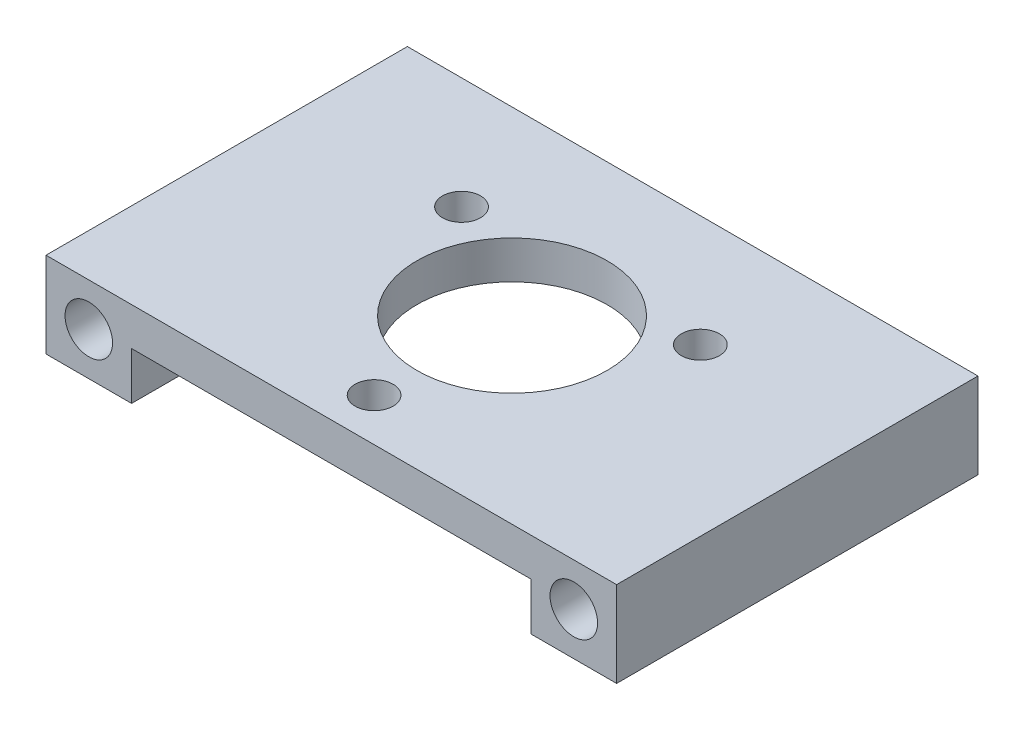
ISO-10303-21;
HEADER;
FILE_DESCRIPTION(('STEP AP214'),'2;1');
FILE_NAME('part.step','',(''),(''),'','','');
FILE_SCHEMA(('AUTOMOTIVE_DESIGN { 1 0 10303 214 1 1 1 1 }'));
ENDSEC;
DATA;
#1=APPLICATION_CONTEXT('core data for automotive mechanical design processes');
#2=APPLICATION_PROTOCOL_DEFINITION('international standard','automotive_design',2000,#1);
#3=PRODUCT_CONTEXT('',#1,'mechanical');
#4=PRODUCT('Part','Part','',(#3));
#5=PRODUCT_RELATED_PRODUCT_CATEGORY('part','',(#4));
#6=PRODUCT_DEFINITION_FORMATION('','',#4);
#7=PRODUCT_DEFINITION_CONTEXT('part definition',#1,'design');
#8=PRODUCT_DEFINITION('design','',#6,#7);
#9=PRODUCT_DEFINITION_SHAPE('','',#8);
#10=(LENGTH_UNIT() NAMED_UNIT(*) SI_UNIT(.MILLI.,.METRE.));
#11=(NAMED_UNIT(*) PLANE_ANGLE_UNIT() SI_UNIT($,.RADIAN.));
#12=(NAMED_UNIT(*) SI_UNIT($,.STERADIAN.) SOLID_ANGLE_UNIT());
#13=UNCERTAINTY_MEASURE_WITH_UNIT(LENGTH_MEASURE(1.E-05),#10,'distance_accuracy_value','');
#14=(GEOMETRIC_REPRESENTATION_CONTEXT(3) GLOBAL_UNCERTAINTY_ASSIGNED_CONTEXT((#13)) GLOBAL_UNIT_ASSIGNED_CONTEXT((#10,
#11,#12)) REPRESENTATION_CONTEXT('',''));
#15=CARTESIAN_POINT('',(0.,0.,0.));
#16=DIRECTION('',(0.,0.,1.));
#17=DIRECTION('',(1.,0.,0.));
#18=AXIS2_PLACEMENT_3D('',#15,#16,#17);
#19=CARTESIAN_POINT('',(32.5614985856646,-4.80041123780256,8.13630311528777));
#20=DIRECTION('',(0.,0.,-1.));
#21=DIRECTION('',(-1.,0.,0.));
#22=AXIS2_PLACEMENT_3D('',#19,#20,#21);
#23=PLANE('',#22);
#24=DIRECTION('',(-1.,0.,0.));
#25=VECTOR('',#24,1.);
#26=CARTESIAN_POINT('',(2.5614985856646,-4.80041123780256,8.13630311528777));
#27=LINE('',#26,#25);
#28=CARTESIAN_POINT('',(62.5614985856646,-4.80041123780256,8.13630311528777));
#29=VERTEX_POINT('',#28);
#30=CARTESIAN_POINT('',(2.5614985856646,-4.80041123780256,8.13630311528777));
#31=VERTEX_POINT('',#30);
#32=EDGE_CURVE('E130',#29,#31,#27,.T.);
#33=ORIENTED_EDGE('',*,*,#32,.T.);
#34=DIRECTION('',(0.,-1.,0.));
#35=VECTOR('',#34,1.);
#36=CARTESIAN_POINT('',(2.5614985856646,-4.80041123780256,8.13630311528777));
#37=LINE('',#36,#35);
#38=CARTESIAN_POINT('',(2.5614985856646,-13.8004112378026,8.13630311528777));
#39=VERTEX_POINT('',#38);
#40=EDGE_CURVE('E78',#31,#39,#37,.T.);
#41=ORIENTED_EDGE('',*,*,#40,.T.);
#42=DIRECTION('',(1.,0.,0.));
#43=VECTOR('',#42,1.);
#44=CARTESIAN_POINT('',(2.5614985856646,-13.8004112378026,8.13630311528777));
#45=LINE('',#44,#43);
#46=CARTESIAN_POINT('',(11.5614985856646,-13.8004112378026,8.13630311528777));
#47=VERTEX_POINT('',#46);
#48=EDGE_CURVE('E145',#39,#47,#45,.T.);
#49=ORIENTED_EDGE('',*,*,#48,.T.);
#50=DIRECTION('',(0.,1.,0.));
#51=VECTOR('',#50,1.);
#52=CARTESIAN_POINT('',(11.5614985856646,-13.8004112378026,8.13630311528777));
#53=LINE('',#52,#51);
#54=CARTESIAN_POINT('',(11.5614985856646,-8.80041123780256,8.13630311528777));
#55=VERTEX_POINT('',#54);
#56=EDGE_CURVE('E158',#47,#55,#53,.T.);
#57=ORIENTED_EDGE('',*,*,#56,.T.);
#58=DIRECTION('',(1.,0.,0.));
#59=VECTOR('',#58,1.);
#60=CARTESIAN_POINT('',(11.5614985856646,-8.80041123780256,8.13630311528777));
#61=LINE('',#60,#59);
#62=CARTESIAN_POINT('',(53.5614985856646,-8.80041123780256,8.13630311528777));
#63=VERTEX_POINT('',#62);
#64=EDGE_CURVE('E97',#55,#63,#61,.T.);
#65=ORIENTED_EDGE('',*,*,#64,.T.);
#66=DIRECTION('',(0.,-1.,0.));
#67=VECTOR('',#66,1.);
#68=CARTESIAN_POINT('',(53.5614985856646,-13.8004112378026,8.13630311528777));
#69=LINE('',#68,#67);
#70=CARTESIAN_POINT('',(53.5614985856646,-13.8004112378026,8.13630311528777));
#71=VERTEX_POINT('',#70);
#72=EDGE_CURVE('E91',#63,#71,#69,.T.);
#73=ORIENTED_EDGE('',*,*,#72,.T.);
#74=DIRECTION('',(1.,0.,0.));
#75=VECTOR('',#74,1.);
#76=CARTESIAN_POINT('',(62.5614985856646,-13.8004112378026,8.13630311528777));
#77=LINE('',#76,#75);
#78=CARTESIAN_POINT('',(62.5614985856646,-13.8004112378026,8.13630311528777));
#79=VERTEX_POINT('',#78);
#80=EDGE_CURVE('E95',#71,#79,#77,.T.);
#81=ORIENTED_EDGE('',*,*,#80,.T.);
#82=DIRECTION('',(0.,1.,0.));
#83=VECTOR('',#82,1.);
#84=CARTESIAN_POINT('',(62.5614985856646,-4.80041123780256,8.13630311528777));
#85=LINE('',#84,#83);
#86=EDGE_CURVE('E35',#79,#29,#85,.T.);
#87=ORIENTED_EDGE('',*,*,#86,.T.);
#88=EDGE_LOOP('',(#33,#41,#49,#57,#65,#73,#81,#87));
#89=FACE_BOUND('',#88,.T.);
#90=CARTESIAN_POINT('',(58.0614985856646,-9.30041123780256,8.13630311528777));
#91=DIRECTION('',(0.,0.,1.));
#92=DIRECTION('',(-1.,0.,0.));
#93=AXIS2_PLACEMENT_3D('',#90,#91,#92);
#94=CIRCLE('',#93,2.5);
#95=CARTESIAN_POINT('',(55.5614985856646,-9.30041123780256,8.13630311528777));
#96=VERTEX_POINT('',#95);
#97=EDGE_CURVE('E119',#96,#96,#94,.T.);
#98=ORIENTED_EDGE('',*,*,#97,.F.);
#99=EDGE_LOOP('',(#98));
#100=FACE_BOUND('',#99,.T.);
#101=CARTESIAN_POINT('',(7.0614985856646,-9.30041123780256,8.13630311528777));
#102=DIRECTION('',(0.,0.,1.));
#103=DIRECTION('',(1.,0.,0.));
#104=AXIS2_PLACEMENT_3D('',#101,#102,#103);
#105=CIRCLE('',#104,2.5);
#106=CARTESIAN_POINT('',(9.56149858566459,-9.30041123780256,8.13630311528777));
#107=VERTEX_POINT('',#106);
#108=EDGE_CURVE('E167',#107,#107,#105,.T.);
#109=ORIENTED_EDGE('',*,*,#108,.F.);
#110=EDGE_LOOP('',(#109));
#111=FACE_BOUND('',#110,.T.);
#112=ADVANCED_FACE('F18',(#89,#100,#111),#23,.F.);
#113=CARTESIAN_POINT('',(32.5614985856646,-4.80041123780256,-29.8636968847122));
#114=DIRECTION('',(0.,0.,-1.));
#115=DIRECTION('',(-1.,0.,0.));
#116=AXIS2_PLACEMENT_3D('',#113,#114,#115);
#117=PLANE('',#116);
#118=CARTESIAN_POINT('',(58.0614985856646,-9.30041123780256,-29.8636968847122));
#119=DIRECTION('',(0.,0.,1.));
#120=DIRECTION('',(-1.,0.,0.));
#121=AXIS2_PLACEMENT_3D('',#118,#119,#120);
#122=CIRCLE('',#121,2.5);
#123=CARTESIAN_POINT('',(55.5614985856646,-9.30041123780256,-29.8636968847122));
#124=VERTEX_POINT('',#123);
#125=EDGE_CURVE('E164',#124,#124,#122,.T.);
#126=ORIENTED_EDGE('',*,*,#125,.T.);
#127=EDGE_LOOP('',(#126));
#128=FACE_BOUND('',#127,.T.);
#129=DIRECTION('',(-1.,0.,0.));
#130=VECTOR('',#129,1.);
#131=CARTESIAN_POINT('',(2.5614985856646,-4.80041123780256,-29.8636968847122));
#132=LINE('',#131,#130);
#133=CARTESIAN_POINT('',(62.5614985856646,-4.80041123780256,-29.8636968847122));
#134=VERTEX_POINT('',#133);
#135=CARTESIAN_POINT('',(2.5614985856646,-4.80041123780256,-29.8636968847122));
#136=VERTEX_POINT('',#135);
#137=EDGE_CURVE('E115',#134,#136,#132,.T.);
#138=ORIENTED_EDGE('',*,*,#137,.F.);
#139=DIRECTION('',(0.,1.,0.));
#140=VECTOR('',#139,1.);
#141=CARTESIAN_POINT('',(62.5614985856646,-4.80041123780256,-29.8636968847122));
#142=LINE('',#141,#140);
#143=CARTESIAN_POINT('',(62.5614985856646,-13.8004112378026,-29.8636968847122));
#144=VERTEX_POINT('',#143);
#145=EDGE_CURVE('E70',#144,#134,#142,.T.);
#146=ORIENTED_EDGE('',*,*,#145,.F.);
#147=DIRECTION('',(1.,0.,0.));
#148=VECTOR('',#147,1.);
#149=CARTESIAN_POINT('',(62.5614985856646,-13.8004112378026,-29.8636968847122));
#150=LINE('',#149,#148);
#151=CARTESIAN_POINT('',(53.5614985856646,-13.8004112378026,-29.8636968847122));
#152=VERTEX_POINT('',#151);
#153=EDGE_CURVE('E64',#152,#144,#150,.T.);
#154=ORIENTED_EDGE('',*,*,#153,.F.);
#155=DIRECTION('',(0.,-1.,0.));
#156=VECTOR('',#155,1.);
#157=CARTESIAN_POINT('',(53.5614985856646,-13.8004112378026,-29.8636968847122));
#158=LINE('',#157,#156);
#159=CARTESIAN_POINT('',(53.5614985856646,-8.80041123780256,-29.8636968847122));
#160=VERTEX_POINT('',#159);
#161=EDGE_CURVE('E105',#160,#152,#158,.T.);
#162=ORIENTED_EDGE('',*,*,#161,.F.);
#163=DIRECTION('',(1.,0.,0.));
#164=VECTOR('',#163,1.);
#165=CARTESIAN_POINT('',(11.5614985856646,-8.80041123780256,-29.8636968847122));
#166=LINE('',#165,#164);
#167=CARTESIAN_POINT('',(11.5614985856646,-8.80041123780256,-29.8636968847122));
#168=VERTEX_POINT('',#167);
#169=EDGE_CURVE('E125',#168,#160,#166,.T.);
#170=ORIENTED_EDGE('',*,*,#169,.F.);
#171=DIRECTION('',(0.,1.,0.));
#172=VECTOR('',#171,1.);
#173=CARTESIAN_POINT('',(11.5614985856646,-13.8004112378026,-29.8636968847122));
#174=LINE('',#173,#172);
#175=CARTESIAN_POINT('',(11.5614985856646,-13.8004112378026,-29.8636968847122));
#176=VERTEX_POINT('',#175);
#177=EDGE_CURVE('E123',#176,#168,#174,.T.);
#178=ORIENTED_EDGE('',*,*,#177,.F.);
#179=DIRECTION('',(1.,0.,0.));
#180=VECTOR('',#179,1.);
#181=CARTESIAN_POINT('',(2.5614985856646,-13.8004112378026,-29.8636968847122));
#182=LINE('',#181,#180);
#183=CARTESIAN_POINT('',(2.5614985856646,-13.8004112378026,-29.8636968847122));
#184=VERTEX_POINT('',#183);
#185=EDGE_CURVE('E121',#184,#176,#182,.T.);
#186=ORIENTED_EDGE('',*,*,#185,.F.);
#187=DIRECTION('',(0.,-1.,0.));
#188=VECTOR('',#187,1.);
#189=CARTESIAN_POINT('',(2.5614985856646,-4.80041123780256,-29.8636968847122));
#190=LINE('',#189,#188);
#191=EDGE_CURVE('E118',#136,#184,#190,.T.);
#192=ORIENTED_EDGE('',*,*,#191,.F.);
#193=EDGE_LOOP('',(#138,#146,#154,#162,#170,#178,#186,#192));
#194=FACE_BOUND('',#193,.T.);
#195=CARTESIAN_POINT('',(7.0614985856646,-9.30041123780256,-29.8636968847122));
#196=DIRECTION('',(0.,0.,1.));
#197=DIRECTION('',(1.,0.,0.));
#198=AXIS2_PLACEMENT_3D('',#195,#196,#197);
#199=CIRCLE('',#198,2.5);
#200=CARTESIAN_POINT('',(9.56149858566459,-9.30041123780256,-29.8636968847122));
#201=VERTEX_POINT('',#200);
#202=EDGE_CURVE('E170',#201,#201,#199,.T.);
#203=ORIENTED_EDGE('',*,*,#202,.T.);
#204=EDGE_LOOP('',(#203));
#205=FACE_BOUND('',#204,.T.);
#206=ADVANCED_FACE('F149',(#128,#194,#205),#117,.T.);
#207=CARTESIAN_POINT('',(2.5614985856646,-4.80041123780256,8.13630311528777));
#208=DIRECTION('',(0.,-1.,0.));
#209=DIRECTION('',(1.,0.,0.));
#210=AXIS2_PLACEMENT_3D('',#207,#208,#209);
#211=PLANE('',#210);
#212=CARTESIAN_POINT('',(20.0041302307911,-4.80041123780256,-18.1136968847126));
#213=DIRECTION('',(0.,-1.,0.));
#214=DIRECTION('',(1.,0.,0.));
#215=AXIS2_PLACEMENT_3D('',#212,#213,#214);
#216=CIRCLE('',#215,2.);
#217=CARTESIAN_POINT('',(22.0041302307911,-4.80041123780256,-18.1136968847126));
#218=VERTEX_POINT('',#217);
#219=EDGE_CURVE('E173',#218,#218,#216,.T.);
#220=ORIENTED_EDGE('',*,*,#219,.T.);
#221=EDGE_LOOP('',(#220));
#222=FACE_BOUND('',#221,.T.);
#223=CARTESIAN_POINT('',(45.1188669405398,-4.80041123780256,-18.1136968847118));
#224=DIRECTION('',(0.,-1.,0.));
#225=DIRECTION('',(1.,0.,0.));
#226=AXIS2_PLACEMENT_3D('',#223,#224,#225);
#227=CIRCLE('',#226,2.);
#228=CARTESIAN_POINT('',(47.1188669405399,-4.80041123780256,-18.1136968847118));
#229=VERTEX_POINT('',#228);
#230=EDGE_CURVE('E178',#229,#229,#227,.T.);
#231=ORIENTED_EDGE('',*,*,#230,.T.);
#232=EDGE_LOOP('',(#231));
#233=FACE_BOUND('',#232,.T.);
#234=CARTESIAN_POINT('',(32.5614985856646,-4.80041123780256,3.63630311528778));
#235=DIRECTION('',(0.,-1.,0.));
#236=DIRECTION('',(1.,0.,0.));
#237=AXIS2_PLACEMENT_3D('',#234,#235,#236);
#238=CIRCLE('',#237,2.);
#239=CARTESIAN_POINT('',(34.5614985856646,-4.80041123780256,3.63630311528778));
#240=VERTEX_POINT('',#239);
#241=EDGE_CURVE('E181',#240,#240,#238,.T.);
#242=ORIENTED_EDGE('',*,*,#241,.T.);
#243=EDGE_LOOP('',(#242));
#244=FACE_BOUND('',#243,.T.);
#245=CARTESIAN_POINT('',(32.5614985856646,-4.80041123780256,-10.8636968847122));
#246=DIRECTION('',(0.,-1.,0.));
#247=DIRECTION('',(1.,0.,0.));
#248=AXIS2_PLACEMENT_3D('',#245,#246,#247);
#249=CIRCLE('',#248,10.);
#250=CARTESIAN_POINT('',(42.5614985856646,-4.80041123780256,-10.8636968847122));
#251=VERTEX_POINT('',#250);
#252=EDGE_CURVE('E184',#251,#251,#249,.T.);
#253=ORIENTED_EDGE('',*,*,#252,.T.);
#254=EDGE_LOOP('',(#253));
#255=FACE_BOUND('',#254,.T.);
#256=ORIENTED_EDGE('',*,*,#137,.T.);
#257=DIRECTION('',(0.,0.,-1.));
#258=VECTOR('',#257,1.);
#259=CARTESIAN_POINT('',(2.5614985856646,-4.80041123780256,8.13630311528777));
#260=LINE('',#259,#258);
#261=EDGE_CURVE('E10',#31,#136,#260,.T.);
#262=ORIENTED_EDGE('',*,*,#261,.F.);
#263=ORIENTED_EDGE('',*,*,#32,.F.);
#264=DIRECTION('',(0.,0.,-1.));
#265=VECTOR('',#264,1.);
#266=CARTESIAN_POINT('',(62.5614985856646,-4.80041123780256,8.13630311528777));
#267=LINE('',#266,#265);
#268=EDGE_CURVE('E111',#29,#134,#267,.T.);
#269=ORIENTED_EDGE('',*,*,#268,.T.);
#270=EDGE_LOOP('',(#256,#262,#263,#269));
#271=FACE_BOUND('',#270,.T.);
#272=ADVANCED_FACE('F20',(#222,#233,#244,#255,#271),#211,.F.);
#273=CARTESIAN_POINT('',(2.5614985856646,-4.80041123780256,8.13630311528777));
#274=DIRECTION('',(1.,0.,0.));
#275=DIRECTION('',(0.,0.,-1.));
#276=AXIS2_PLACEMENT_3D('',#273,#274,#275);
#277=PLANE('',#276);
#278=ORIENTED_EDGE('',*,*,#191,.T.);
#279=DIRECTION('',(0.,0.,-1.));
#280=VECTOR('',#279,1.);
#281=CARTESIAN_POINT('',(2.5614985856646,-13.8004112378026,8.13630311528777));
#282=LINE('',#281,#280);
#283=EDGE_CURVE('E27',#39,#184,#282,.T.);
#284=ORIENTED_EDGE('',*,*,#283,.F.);
#285=ORIENTED_EDGE('',*,*,#40,.F.);
#286=ORIENTED_EDGE('',*,*,#261,.T.);
#287=EDGE_LOOP('',(#278,#284,#285,#286));
#288=FACE_BOUND('',#287,.T.);
#289=ADVANCED_FACE('F218',(#288),#277,.F.);
#290=CARTESIAN_POINT('',(2.5614985856646,-13.8004112378026,8.13630311528777));
#291=DIRECTION('',(0.,1.,0.));
#292=DIRECTION('',(0.,0.,1.));
#293=AXIS2_PLACEMENT_3D('',#290,#291,#292);
#294=PLANE('',#293);
#295=ORIENTED_EDGE('',*,*,#185,.T.);
#296=DIRECTION('',(0.,0.,-1.));
#297=VECTOR('',#296,1.);
#298=CARTESIAN_POINT('',(11.5614985856646,-13.8004112378026,8.13630311528777));
#299=LINE('',#298,#297);
#300=EDGE_CURVE('E137',#47,#176,#299,.T.);
#301=ORIENTED_EDGE('',*,*,#300,.F.);
#302=ORIENTED_EDGE('',*,*,#48,.F.);
#303=ORIENTED_EDGE('',*,*,#283,.T.);
#304=EDGE_LOOP('',(#295,#301,#302,#303));
#305=FACE_BOUND('',#304,.T.);
#306=ADVANCED_FACE('F143',(#305),#294,.F.);
#307=CARTESIAN_POINT('',(11.5614985856646,-13.8004112378026,8.13630311528777));
#308=DIRECTION('',(-1.,0.,0.));
#309=DIRECTION('',(0.,0.,1.));
#310=AXIS2_PLACEMENT_3D('',#307,#308,#309);
#311=PLANE('',#310);
#312=ORIENTED_EDGE('',*,*,#177,.T.);
#313=DIRECTION('',(0.,0.,-1.));
#314=VECTOR('',#313,1.);
#315=CARTESIAN_POINT('',(11.5614985856646,-8.80041123780256,8.13630311528777));
#316=LINE('',#315,#314);
#317=EDGE_CURVE('E134',#55,#168,#316,.T.);
#318=ORIENTED_EDGE('',*,*,#317,.F.);
#319=ORIENTED_EDGE('',*,*,#56,.F.);
#320=ORIENTED_EDGE('',*,*,#300,.T.);
#321=EDGE_LOOP('',(#312,#318,#319,#320));
#322=FACE_BOUND('',#321,.T.);
#323=ADVANCED_FACE('F154',(#322),#311,.F.);
#324=CARTESIAN_POINT('',(11.5614985856646,-8.80041123780256,8.13630311528777));
#325=DIRECTION('',(0.,1.,0.));
#326=DIRECTION('',(0.,0.,1.));
#327=AXIS2_PLACEMENT_3D('',#324,#325,#326);
#328=PLANE('',#327);
#329=CARTESIAN_POINT('',(20.0041302307911,-8.80041123780256,-18.1136968847126));
#330=DIRECTION('',(0.,-1.,0.));
#331=DIRECTION('',(1.,0.,0.));
#332=AXIS2_PLACEMENT_3D('',#329,#330,#331);
#333=CIRCLE('',#332,2.);
#334=CARTESIAN_POINT('',(22.0041302307911,-8.80041123780256,-18.1136968847126));
#335=VERTEX_POINT('',#334);
#336=EDGE_CURVE('E191',#335,#335,#333,.T.);
#337=ORIENTED_EDGE('',*,*,#336,.F.);
#338=EDGE_LOOP('',(#337));
#339=FACE_BOUND('',#338,.T.);
#340=CARTESIAN_POINT('',(45.1188669405398,-8.80041123780256,-18.1136968847118));
#341=DIRECTION('',(0.,-1.,0.));
#342=DIRECTION('',(1.,0.,0.));
#343=AXIS2_PLACEMENT_3D('',#340,#341,#342);
#344=CIRCLE('',#343,2.);
#345=CARTESIAN_POINT('',(47.1188669405399,-8.80041123780256,-18.1136968847118));
#346=VERTEX_POINT('',#345);
#347=EDGE_CURVE('E194',#346,#346,#344,.T.);
#348=ORIENTED_EDGE('',*,*,#347,.F.);
#349=EDGE_LOOP('',(#348));
#350=FACE_BOUND('',#349,.T.);
#351=CARTESIAN_POINT('',(32.5614985856646,-8.80041123780256,3.63630311528778));
#352=DIRECTION('',(0.,-1.,0.));
#353=DIRECTION('',(1.,0.,0.));
#354=AXIS2_PLACEMENT_3D('',#351,#352,#353);
#355=CIRCLE('',#354,2.);
#356=CARTESIAN_POINT('',(34.5614985856646,-8.80041123780256,3.63630311528778));
#357=VERTEX_POINT('',#356);
#358=EDGE_CURVE('E190',#357,#357,#355,.T.);
#359=ORIENTED_EDGE('',*,*,#358,.F.);
#360=EDGE_LOOP('',(#359));
#361=FACE_BOUND('',#360,.T.);
#362=CARTESIAN_POINT('',(32.5614985856646,-8.80041123780256,-10.8636968847122));
#363=DIRECTION('',(0.,-1.,0.));
#364=DIRECTION('',(1.,0.,0.));
#365=AXIS2_PLACEMENT_3D('',#362,#363,#364);
#366=CIRCLE('',#365,10.);
#367=CARTESIAN_POINT('',(42.5614985856646,-8.80041123780256,-10.8636968847122));
#368=VERTEX_POINT('',#367);
#369=EDGE_CURVE('E187',#368,#368,#366,.T.);
#370=ORIENTED_EDGE('',*,*,#369,.F.);
#371=EDGE_LOOP('',(#370));
#372=FACE_BOUND('',#371,.T.);
#373=ORIENTED_EDGE('',*,*,#169,.T.);
#374=DIRECTION('',(0.,0.,-1.));
#375=VECTOR('',#374,1.);
#376=CARTESIAN_POINT('',(53.5614985856646,-8.80041123780256,8.13630311528777));
#377=LINE('',#376,#375);
#378=EDGE_CURVE('E106',#63,#160,#377,.T.);
#379=ORIENTED_EDGE('',*,*,#378,.F.);
#380=ORIENTED_EDGE('',*,*,#64,.F.);
#381=ORIENTED_EDGE('',*,*,#317,.T.);
#382=EDGE_LOOP('',(#373,#379,#380,#381));
#383=FACE_BOUND('',#382,.T.);
#384=ADVANCED_FACE('F157',(#339,#350,#361,#372,#383),#328,.F.);
#385=CARTESIAN_POINT('',(53.5614985856646,-13.8004112378026,8.13630311528777));
#386=DIRECTION('',(1.,0.,0.));
#387=DIRECTION('',(0.,1.,0.));
#388=AXIS2_PLACEMENT_3D('',#385,#386,#387);
#389=PLANE('',#388);
#390=ORIENTED_EDGE('',*,*,#161,.T.);
#391=DIRECTION('',(0.,0.,-1.));
#392=VECTOR('',#391,1.);
#393=CARTESIAN_POINT('',(53.5614985856646,-13.8004112378026,8.13630311528777));
#394=LINE('',#393,#392);
#395=EDGE_CURVE('E102',#71,#152,#394,.T.);
#396=ORIENTED_EDGE('',*,*,#395,.F.);
#397=ORIENTED_EDGE('',*,*,#72,.F.);
#398=ORIENTED_EDGE('',*,*,#378,.T.);
#399=EDGE_LOOP('',(#390,#396,#397,#398));
#400=FACE_BOUND('',#399,.T.);
#401=ADVANCED_FACE('F103',(#400),#389,.F.);
#402=CARTESIAN_POINT('',(62.5614985856646,-13.8004112378026,8.13630311528777));
#403=DIRECTION('',(0.,1.,0.));
#404=DIRECTION('',(0.,0.,1.));
#405=AXIS2_PLACEMENT_3D('',#402,#403,#404);
#406=PLANE('',#405);
#407=ORIENTED_EDGE('',*,*,#153,.T.);
#408=DIRECTION('',(0.,0.,-1.));
#409=VECTOR('',#408,1.);
#410=CARTESIAN_POINT('',(62.5614985856646,-13.8004112378026,8.13630311528777));
#411=LINE('',#410,#409);
#412=EDGE_CURVE('E107',#79,#144,#411,.T.);
#413=ORIENTED_EDGE('',*,*,#412,.F.);
#414=ORIENTED_EDGE('',*,*,#80,.F.);
#415=ORIENTED_EDGE('',*,*,#395,.T.);
#416=EDGE_LOOP('',(#407,#413,#414,#415));
#417=FACE_BOUND('',#416,.T.);
#418=ADVANCED_FACE('F109',(#417),#406,.F.);
#419=CARTESIAN_POINT('',(62.5614985856646,-4.80041123780256,8.13630311528777));
#420=DIRECTION('',(-1.,0.,0.));
#421=DIRECTION('',(0.,0.,1.));
#422=AXIS2_PLACEMENT_3D('',#419,#420,#421);
#423=PLANE('',#422);
#424=ORIENTED_EDGE('',*,*,#145,.T.);
#425=ORIENTED_EDGE('',*,*,#268,.F.);
#426=ORIENTED_EDGE('',*,*,#86,.F.);
#427=ORIENTED_EDGE('',*,*,#412,.T.);
#428=EDGE_LOOP('',(#424,#425,#426,#427));
#429=FACE_BOUND('',#428,.T.);
#430=ADVANCED_FACE('F222',(#429),#423,.F.);
#431=CARTESIAN_POINT('',(58.0614985856646,-9.30041123780256,8.13630311528777));
#432=DIRECTION('',(0.,0.,-1.));
#433=DIRECTION('',(-1.,0.,0.));
#434=AXIS2_PLACEMENT_3D('',#431,#432,#433);
#435=CYLINDRICAL_SURFACE('',#434,2.5);
#436=ORIENTED_EDGE('',*,*,#97,.T.);
#437=EDGE_LOOP('',(#436));
#438=FACE_BOUND('',#437,.T.);
#439=ORIENTED_EDGE('',*,*,#125,.F.);
#440=EDGE_LOOP('',(#439));
#441=FACE_BOUND('',#440,.T.);
#442=ADVANCED_FACE('F224',(#438,#441),#435,.F.);
#443=CARTESIAN_POINT('',(7.0614985856646,-9.30041123780256,8.13630311528777));
#444=DIRECTION('',(0.,0.,-1.));
#445=DIRECTION('',(-1.,0.,0.));
#446=AXIS2_PLACEMENT_3D('',#443,#444,#445);
#447=CYLINDRICAL_SURFACE('',#446,2.5);
#448=ORIENTED_EDGE('',*,*,#108,.T.);
#449=EDGE_LOOP('',(#448));
#450=FACE_BOUND('',#449,.T.);
#451=ORIENTED_EDGE('',*,*,#202,.F.);
#452=EDGE_LOOP('',(#451));
#453=FACE_BOUND('',#452,.T.);
#454=ADVANCED_FACE('F212',(#450,#453),#447,.F.);
#455=CARTESIAN_POINT('',(32.5614985856646,29.1995887621974,-10.8636968847122));
#456=DIRECTION('',(0.,-1.,0.));
#457=DIRECTION('',(1.,0.,0.));
#458=AXIS2_PLACEMENT_3D('',#455,#456,#457);
#459=CYLINDRICAL_SURFACE('',#458,10.);
#460=ORIENTED_EDGE('',*,*,#369,.T.);
#461=EDGE_LOOP('',(#460));
#462=FACE_BOUND('',#461,.T.);
#463=ORIENTED_EDGE('',*,*,#252,.F.);
#464=EDGE_LOOP('',(#463));
#465=FACE_BOUND('',#464,.T.);
#466=ADVANCED_FACE('F209',(#462,#465),#459,.F.);
#467=CARTESIAN_POINT('',(32.5614985856646,29.1995887621974,3.63630311528778));
#468=DIRECTION('',(0.,-1.,0.));
#469=DIRECTION('',(1.,0.,0.));
#470=AXIS2_PLACEMENT_3D('',#467,#468,#469);
#471=CYLINDRICAL_SURFACE('',#470,2.);
#472=ORIENTED_EDGE('',*,*,#358,.T.);
#473=EDGE_LOOP('',(#472));
#474=FACE_BOUND('',#473,.T.);
#475=ORIENTED_EDGE('',*,*,#241,.F.);
#476=EDGE_LOOP('',(#475));
#477=FACE_BOUND('',#476,.T.);
#478=ADVANCED_FACE('F200',(#474,#477),#471,.F.);
#479=CARTESIAN_POINT('',(45.1188669405398,29.1995887621974,-18.1136968847118));
#480=DIRECTION('',(0.,-1.,0.));
#481=DIRECTION('',(1.,0.,0.));
#482=AXIS2_PLACEMENT_3D('',#479,#480,#481);
#483=CYLINDRICAL_SURFACE('',#482,2.);
#484=ORIENTED_EDGE('',*,*,#347,.T.);
#485=EDGE_LOOP('',(#484));
#486=FACE_BOUND('',#485,.T.);
#487=ORIENTED_EDGE('',*,*,#230,.F.);
#488=EDGE_LOOP('',(#487));
#489=FACE_BOUND('',#488,.T.);
#490=ADVANCED_FACE('F248',(#486,#489),#483,.F.);
#491=CARTESIAN_POINT('',(20.0041302307911,29.1995887621974,-18.1136968847126));
#492=DIRECTION('',(0.,-1.,0.));
#493=DIRECTION('',(1.,0.,0.));
#494=AXIS2_PLACEMENT_3D('',#491,#492,#493);
#495=CYLINDRICAL_SURFACE('',#494,2.);
#496=ORIENTED_EDGE('',*,*,#336,.T.);
#497=EDGE_LOOP('',(#496));
#498=FACE_BOUND('',#497,.T.);
#499=ORIENTED_EDGE('',*,*,#219,.F.);
#500=EDGE_LOOP('',(#499));
#501=FACE_BOUND('',#500,.T.);
#502=ADVANCED_FACE('F245',(#498,#501),#495,.F.);
#503=CLOSED_SHELL('',(#112,#206,#272,#289,#306,#323,#384,#401,#418,#430,#442,#454,#466,#478,
#490,#502));
#504=MANIFOLD_SOLID_BREP('B1',#503);
#505=ADVANCED_BREP_SHAPE_REPRESENTATION('',(#18,#504),#14);
#506=SHAPE_DEFINITION_REPRESENTATION(#9,#505);
ENDSEC;
END-ISO-10303-21;
